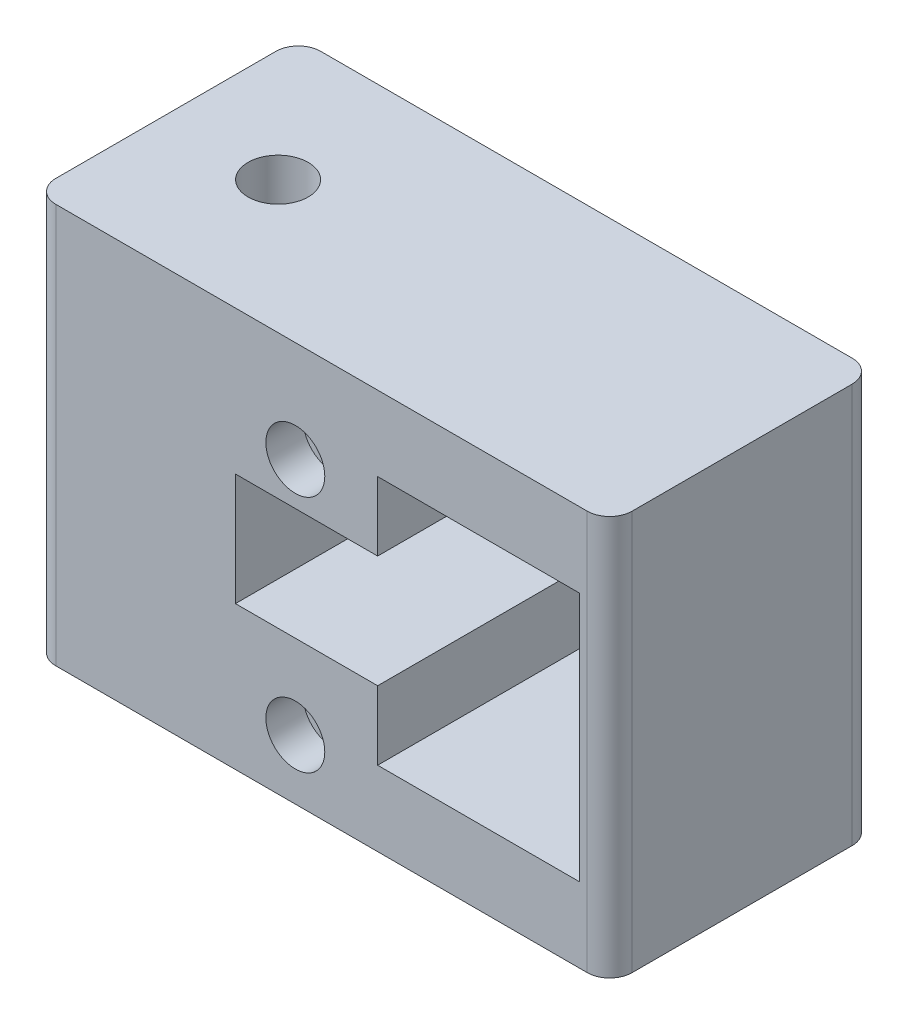
ISO-10303-21;
HEADER;
FILE_DESCRIPTION(('STEP AP214'),'2;1');
FILE_NAME('part.step','',(''),(''),'','','');
FILE_SCHEMA(('AUTOMOTIVE_DESIGN { 1 0 10303 214 1 1 1 1 }'));
ENDSEC;
DATA;
#1=APPLICATION_CONTEXT('core data for automotive mechanical design processes');
#2=APPLICATION_PROTOCOL_DEFINITION('international standard','automotive_design',2000,#1);
#3=PRODUCT_CONTEXT('',#1,'mechanical');
#4=PRODUCT('Part','Part','',(#3));
#5=PRODUCT_RELATED_PRODUCT_CATEGORY('part','',(#4));
#6=PRODUCT_DEFINITION_FORMATION('','',#4);
#7=PRODUCT_DEFINITION_CONTEXT('part definition',#1,'design');
#8=PRODUCT_DEFINITION('design','',#6,#7);
#9=PRODUCT_DEFINITION_SHAPE('','',#8);
#10=(LENGTH_UNIT() NAMED_UNIT(*) SI_UNIT(.MILLI.,.METRE.));
#11=(NAMED_UNIT(*) PLANE_ANGLE_UNIT() SI_UNIT($,.RADIAN.));
#12=(NAMED_UNIT(*) SI_UNIT($,.STERADIAN.) SOLID_ANGLE_UNIT());
#13=UNCERTAINTY_MEASURE_WITH_UNIT(LENGTH_MEASURE(1.E-05),#10,'distance_accuracy_value','');
#14=(GEOMETRIC_REPRESENTATION_CONTEXT(3) GLOBAL_UNCERTAINTY_ASSIGNED_CONTEXT((#13)) GLOBAL_UNIT_ASSIGNED_CONTEXT((#10,
#11,#12)) REPRESENTATION_CONTEXT('',''));
#15=CARTESIAN_POINT('',(0.,0.,0.));
#16=DIRECTION('',(0.,0.,1.));
#17=DIRECTION('',(1.,0.,0.));
#18=AXIS2_PLACEMENT_3D('',#15,#16,#17);
#19=CARTESIAN_POINT('',(-31.75,55.118,19.939));
#20=DIRECTION('',(0.,-1.,0.));
#21=DIRECTION('',(0.,0.,-1.));
#22=AXIS2_PLACEMENT_3D('',#19,#20,#21);
#23=CYLINDRICAL_SURFACE('',#22,4.064);
#24=CARTESIAN_POINT('',(-31.75,-12.7,19.939));
#25=DIRECTION('',(0.,-1.,0.));
#26=DIRECTION('',(0.,0.,-1.));
#27=AXIS2_PLACEMENT_3D('',#24,#25,#26);
#28=CIRCLE('',#27,4.064);
#29=CARTESIAN_POINT('',(-31.75,-12.7,15.875));
#30=VERTEX_POINT('',#29);
#31=EDGE_CURVE('E280',#30,#30,#28,.T.);
#32=ORIENTED_EDGE('',*,*,#31,.T.);
#33=EDGE_LOOP('',(#32));
#34=FACE_BOUND('',#33,.T.);
#35=CARTESIAN_POINT('',(-31.75,39.878,19.939));
#36=DIRECTION('',(0.,1.,0.));
#37=DIRECTION('',(0.,0.,1.));
#38=AXIS2_PLACEMENT_3D('',#35,#36,#37);
#39=CIRCLE('',#38,4.064);
#40=CARTESIAN_POINT('',(-31.75,39.878,24.003));
#41=VERTEX_POINT('',#40);
#42=EDGE_CURVE('E215',#41,#41,#39,.F.);
#43=ORIENTED_EDGE('',*,*,#42,.F.);
#44=EDGE_LOOP('',(#43));
#45=FACE_BOUND('',#44,.T.);
#46=ADVANCED_FACE('F35',(#34,#45),#23,.F.);
#47=CARTESIAN_POINT('',(0.,0.,42.418));
#48=DIRECTION('',(0.,0.,1.));
#49=DIRECTION('',(1.,0.,0.));
#50=AXIS2_PLACEMENT_3D('',#47,#48,#49);
#51=PLANE('',#50);
#52=CARTESIAN_POINT('',(-6.34999999999998,37.96,42.418));
#53=DIRECTION('',(0.,0.,1.));
#54=DIRECTION('',(1.,0.,0.));
#55=AXIS2_PLACEMENT_3D('',#52,#53,#54);
#56=CIRCLE('',#55,5.);
#57=CARTESIAN_POINT('',(-1.34999999999998,37.96,42.418));
#58=VERTEX_POINT('',#57);
#59=EDGE_CURVE('E585',#58,#58,#56,.T.);
#60=ORIENTED_EDGE('',*,*,#59,.F.);
#61=EDGE_LOOP('',(#60));
#62=FACE_BOUND('',#61,.T.);
#63=CARTESIAN_POINT('',(-6.34999999999998,-2.54,42.418));
#64=DIRECTION('',(0.,0.,1.));
#65=DIRECTION('',(1.,0.,0.));
#66=AXIS2_PLACEMENT_3D('',#63,#64,#65);
#67=CIRCLE('',#66,5.);
#68=CARTESIAN_POINT('',(-1.34999999999998,-2.54,42.418));
#69=VERTEX_POINT('',#68);
#70=EDGE_CURVE('E218',#69,#69,#67,.T.);
#71=ORIENTED_EDGE('',*,*,#70,.F.);
#72=EDGE_LOOP('',(#71));
#73=FACE_BOUND('',#72,.T.);
#74=DIRECTION('',(-1.,0.,0.));
#75=VECTOR('',#74,1.);
#76=CARTESIAN_POINT('',(-50.8,55.118,42.418));
#77=LINE('',#76,#75);
#78=CARTESIAN_POINT('',(43.18,55.118,42.418));
#79=VERTEX_POINT('',#78);
#80=CARTESIAN_POINT('',(-46.99,55.118,42.418));
#81=VERTEX_POINT('',#80);
#82=EDGE_CURVE('E199',#79,#81,#77,.T.);
#83=ORIENTED_EDGE('',*,*,#82,.T.);
#84=DIRECTION('',(0.,-1.,0.));
#85=VECTOR('',#84,1.);
#86=CARTESIAN_POINT('',(-46.99,-12.7,42.418));
#87=LINE('',#86,#85);
#88=CARTESIAN_POINT('',(-46.99,-12.7,42.418));
#89=VERTEX_POINT('',#88);
#90=EDGE_CURVE('E246',#81,#89,#87,.T.);
#91=ORIENTED_EDGE('',*,*,#90,.T.);
#92=DIRECTION('',(1.,0.,0.));
#93=VECTOR('',#92,1.);
#94=CARTESIAN_POINT('',(-50.8,-12.7,42.418));
#95=LINE('',#94,#93);
#96=CARTESIAN_POINT('',(43.18,-12.7,42.418));
#97=VERTEX_POINT('',#96);
#98=EDGE_CURVE('E197',#89,#97,#95,.T.);
#99=ORIENTED_EDGE('',*,*,#98,.T.);
#100=DIRECTION('',(0.,1.,0.));
#101=VECTOR('',#100,1.);
#102=CARTESIAN_POINT('',(43.18,55.118,42.418));
#103=LINE('',#102,#101);
#104=EDGE_CURVE('E243',#97,#79,#103,.T.);
#105=ORIENTED_EDGE('',*,*,#104,.T.);
#106=EDGE_LOOP('',(#83,#91,#99,#105));
#107=FACE_BOUND('',#106,.T.);
#108=DIRECTION('',(1.,0.,0.));
#109=VECTOR('',#108,1.);
#110=CARTESIAN_POINT('',(7.62,0.,42.418));
#111=LINE('',#110,#109);
#112=CARTESIAN_POINT('',(7.62,0.,42.418));
#113=VERTEX_POINT('',#112);
#114=CARTESIAN_POINT('',(41.91,0.,42.418));
#115=VERTEX_POINT('',#114);
#116=EDGE_CURVE('E179',#113,#115,#111,.T.);
#117=ORIENTED_EDGE('',*,*,#116,.F.);
#118=DIRECTION('',(0.,-1.,0.));
#119=VECTOR('',#118,1.);
#120=CARTESIAN_POINT('',(7.62,0.,42.418));
#121=LINE('',#120,#119);
#122=CARTESIAN_POINT('',(7.62,11.684,42.418));
#123=VERTEX_POINT('',#122);
#124=EDGE_CURVE('E177',#123,#113,#121,.T.);
#125=ORIENTED_EDGE('',*,*,#124,.F.);
#126=DIRECTION('',(1.,0.,0.));
#127=VECTOR('',#126,1.);
#128=CARTESIAN_POINT('',(7.62,11.684,42.418));
#129=LINE('',#128,#127);
#130=CARTESIAN_POINT('',(-16.51,11.684,42.418));
#131=VERTEX_POINT('',#130);
#132=EDGE_CURVE('E157',#131,#123,#129,.T.);
#133=ORIENTED_EDGE('',*,*,#132,.F.);
#134=DIRECTION('',(0.,-1.,0.));
#135=VECTOR('',#134,1.);
#136=CARTESIAN_POINT('',(-16.51,30.734,42.418));
#137=LINE('',#136,#135);
#138=CARTESIAN_POINT('',(-16.51,30.734,42.418));
#139=VERTEX_POINT('',#138);
#140=EDGE_CURVE('E297',#139,#131,#137,.T.);
#141=ORIENTED_EDGE('',*,*,#140,.F.);
#142=DIRECTION('',(-1.,0.,0.));
#143=VECTOR('',#142,1.);
#144=CARTESIAN_POINT('',(7.62,30.734,42.418));
#145=LINE('',#144,#143);
#146=CARTESIAN_POINT('',(7.62,30.734,42.418));
#147=VERTEX_POINT('',#146);
#148=EDGE_CURVE('E295',#147,#139,#145,.T.);
#149=ORIENTED_EDGE('',*,*,#148,.F.);
#150=DIRECTION('',(0.,-1.,0.));
#151=VECTOR('',#150,1.);
#152=CARTESIAN_POINT('',(7.62,30.734,42.418));
#153=LINE('',#152,#151);
#154=CARTESIAN_POINT('',(7.62,42.418,42.418));
#155=VERTEX_POINT('',#154);
#156=EDGE_CURVE('E293',#155,#147,#153,.T.);
#157=ORIENTED_EDGE('',*,*,#156,.F.);
#158=DIRECTION('',(-1.,0.,0.));
#159=VECTOR('',#158,1.);
#160=CARTESIAN_POINT('',(7.62,42.418,42.418));
#161=LINE('',#160,#159);
#162=CARTESIAN_POINT('',(41.91,42.418,42.418));
#163=VERTEX_POINT('',#162);
#164=EDGE_CURVE('E291',#163,#155,#161,.T.);
#165=ORIENTED_EDGE('',*,*,#164,.F.);
#166=DIRECTION('',(0.,1.,0.));
#167=VECTOR('',#166,1.);
#168=CARTESIAN_POINT('',(41.91,0.,42.418));
#169=LINE('',#168,#167);
#170=EDGE_CURVE('E289',#115,#163,#169,.T.);
#171=ORIENTED_EDGE('',*,*,#170,.F.);
#172=EDGE_LOOP('',(#117,#125,#133,#141,#149,#157,#165,#171));
#173=FACE_BOUND('',#172,.T.);
#174=ADVANCED_FACE('F258',(#62,#73,#107,#173),#51,.T.);
#175=CARTESIAN_POINT('',(-50.8,55.118,42.418));
#176=DIRECTION('',(1.,0.,0.));
#177=DIRECTION('',(0.,1.,0.));
#178=AXIS2_PLACEMENT_3D('',#175,#176,#177);
#179=PLANE('',#178);
#180=DIRECTION('',(0.,0.,-1.));
#181=VECTOR('',#180,1.);
#182=CARTESIAN_POINT('',(-50.8,55.118,42.418));
#183=LINE('',#182,#181);
#184=CARTESIAN_POINT('',(-50.8,55.118,38.608));
#185=VERTEX_POINT('',#184);
#186=CARTESIAN_POINT('',(-50.8,55.118,1.27));
#187=VERTEX_POINT('',#186);
#188=EDGE_CURVE('E202',#185,#187,#183,.T.);
#189=ORIENTED_EDGE('',*,*,#188,.T.);
#190=DIRECTION('',(0.,1.,0.));
#191=VECTOR('',#190,1.);
#192=CARTESIAN_POINT('',(-50.8,-12.7,1.27));
#193=LINE('',#192,#191);
#194=CARTESIAN_POINT('',(-50.8,-12.7,1.27));
#195=VERTEX_POINT('',#194);
#196=EDGE_CURVE('E235',#187,#195,#193,.F.);
#197=ORIENTED_EDGE('',*,*,#196,.T.);
#198=DIRECTION('',(0.,0.,-1.));
#199=VECTOR('',#198,1.);
#200=CARTESIAN_POINT('',(-50.8,-12.7,42.418));
#201=LINE('',#200,#199);
#202=CARTESIAN_POINT('',(-50.8,-12.7,38.608));
#203=VERTEX_POINT('',#202);
#204=EDGE_CURVE('E211',#203,#195,#201,.T.);
#205=ORIENTED_EDGE('',*,*,#204,.F.);
#206=DIRECTION('',(0.,-1.,0.));
#207=VECTOR('',#206,1.);
#208=CARTESIAN_POINT('',(-50.8,55.118,38.608));
#209=LINE('',#208,#207);
#210=EDGE_CURVE('E233',#203,#185,#209,.F.);
#211=ORIENTED_EDGE('',*,*,#210,.T.);
#212=EDGE_LOOP('',(#189,#197,#205,#211));
#213=FACE_BOUND('',#212,.T.);
#214=ADVANCED_FACE('F269',(#213),#179,.F.);
#215=CARTESIAN_POINT('',(-50.8,-12.7,42.418));
#216=DIRECTION('',(0.,1.,0.));
#217=DIRECTION('',(0.,0.,1.));
#218=AXIS2_PLACEMENT_3D('',#215,#216,#217);
#219=PLANE('',#218);
#220=ORIENTED_EDGE('',*,*,#31,.F.);
#221=EDGE_LOOP('',(#220));
#222=FACE_BOUND('',#221,.T.);
#223=ORIENTED_EDGE('',*,*,#204,.T.);
#224=CARTESIAN_POINT('',(-46.99,-12.7,1.27));
#225=DIRECTION('',(0.,1.,0.));
#226=DIRECTION('',(0.,0.,1.));
#227=AXIS2_PLACEMENT_3D('',#224,#225,#226);
#228=CIRCLE('',#227,3.81);
#229=CARTESIAN_POINT('',(-46.99,-12.7,-2.54));
#230=VERTEX_POINT('',#229);
#231=EDGE_CURVE('E241',#195,#230,#228,.F.);
#232=ORIENTED_EDGE('',*,*,#231,.T.);
#233=DIRECTION('',(-1.,0.,0.));
#234=VECTOR('',#233,1.);
#235=CARTESIAN_POINT('',(46.99,-12.7,-2.54));
#236=LINE('',#235,#234);
#237=CARTESIAN_POINT('',(43.18,-12.7,-2.54));
#238=VERTEX_POINT('',#237);
#239=EDGE_CURVE('E275',#238,#230,#236,.T.);
#240=ORIENTED_EDGE('',*,*,#239,.F.);
#241=CARTESIAN_POINT('',(43.18,-12.7,1.27));
#242=DIRECTION('',(0.,1.,0.));
#243=DIRECTION('',(0.,0.,1.));
#244=AXIS2_PLACEMENT_3D('',#241,#242,#243);
#245=CIRCLE('',#244,3.81);
#246=CARTESIAN_POINT('',(46.99,-12.7,1.27));
#247=VERTEX_POINT('',#246);
#248=EDGE_CURVE('E238',#238,#247,#245,.F.);
#249=ORIENTED_EDGE('',*,*,#248,.T.);
#250=DIRECTION('',(0.,0.,-1.));
#251=VECTOR('',#250,1.);
#252=CARTESIAN_POINT('',(46.99,-12.7,42.418));
#253=LINE('',#252,#251);
#254=CARTESIAN_POINT('',(46.99,-12.7,38.608));
#255=VERTEX_POINT('',#254);
#256=EDGE_CURVE('E208',#255,#247,#253,.T.);
#257=ORIENTED_EDGE('',*,*,#256,.F.);
#258=CARTESIAN_POINT('',(43.18,-12.7,38.608));
#259=DIRECTION('',(0.,1.,0.));
#260=DIRECTION('',(0.,0.,1.));
#261=AXIS2_PLACEMENT_3D('',#258,#259,#260);
#262=CIRCLE('',#261,3.81);
#263=EDGE_CURVE('E50',#255,#97,#262,.F.);
#264=ORIENTED_EDGE('',*,*,#263,.T.);
#265=ORIENTED_EDGE('',*,*,#98,.F.);
#266=CARTESIAN_POINT('',(-46.99,-12.7,38.608));
#267=DIRECTION('',(0.,1.,0.));
#268=DIRECTION('',(0.,0.,1.));
#269=AXIS2_PLACEMENT_3D('',#266,#267,#268);
#270=CIRCLE('',#269,3.81);
#271=EDGE_CURVE('E58',#89,#203,#270,.F.);
#272=ORIENTED_EDGE('',*,*,#271,.T.);
#273=EDGE_LOOP('',(#223,#232,#240,#249,#257,#264,#265,#272));
#274=FACE_BOUND('',#273,.T.);
#275=ADVANCED_FACE('F253',(#222,#274),#219,.F.);
#276=CARTESIAN_POINT('',(46.99,55.118,42.418));
#277=DIRECTION('',(-1.,0.,0.));
#278=DIRECTION('',(0.,-1.,0.));
#279=AXIS2_PLACEMENT_3D('',#276,#277,#278);
#280=PLANE('',#279);
#281=ORIENTED_EDGE('',*,*,#256,.T.);
#282=DIRECTION('',(0.,-1.,0.));
#283=VECTOR('',#282,1.);
#284=CARTESIAN_POINT('',(46.99,55.118,1.27));
#285=LINE('',#284,#283);
#286=CARTESIAN_POINT('',(46.99,55.118,1.27));
#287=VERTEX_POINT('',#286);
#288=EDGE_CURVE('E11',#247,#287,#285,.F.);
#289=ORIENTED_EDGE('',*,*,#288,.T.);
#290=DIRECTION('',(0.,0.,-1.));
#291=VECTOR('',#290,1.);
#292=CARTESIAN_POINT('',(46.99,55.118,42.418));
#293=LINE('',#292,#291);
#294=CARTESIAN_POINT('',(46.99,55.118,38.608));
#295=VERTEX_POINT('',#294);
#296=EDGE_CURVE('E205',#295,#287,#293,.T.);
#297=ORIENTED_EDGE('',*,*,#296,.F.);
#298=DIRECTION('',(0.,1.,0.));
#299=VECTOR('',#298,1.);
#300=CARTESIAN_POINT('',(46.99,-12.7,38.608));
#301=LINE('',#300,#299);
#302=EDGE_CURVE('E43',#295,#255,#301,.F.);
#303=ORIENTED_EDGE('',*,*,#302,.T.);
#304=EDGE_LOOP('',(#281,#289,#297,#303));
#305=FACE_BOUND('',#304,.T.);
#306=ADVANCED_FACE('F250',(#305),#280,.F.);
#307=CARTESIAN_POINT('',(-50.8,55.118,42.418));
#308=DIRECTION('',(0.,-1.,0.));
#309=DIRECTION('',(0.,0.,-1.));
#310=AXIS2_PLACEMENT_3D('',#307,#308,#309);
#311=PLANE('',#310);
#312=CARTESIAN_POINT('',(-31.75,55.118,19.939));
#313=DIRECTION('',(0.,1.,0.));
#314=DIRECTION('',(0.,0.,1.));
#315=AXIS2_PLACEMENT_3D('',#312,#313,#314);
#316=CIRCLE('',#315,5.1);
#317=CARTESIAN_POINT('',(-31.75,55.118,25.039));
#318=VERTEX_POINT('',#317);
#319=EDGE_CURVE('E577',#318,#318,#316,.T.);
#320=ORIENTED_EDGE('',*,*,#319,.F.);
#321=EDGE_LOOP('',(#320));
#322=FACE_BOUND('',#321,.T.);
#323=DIRECTION('',(1.,0.,0.));
#324=VECTOR('',#323,1.);
#325=CARTESIAN_POINT('',(46.99,55.118,-2.54));
#326=LINE('',#325,#324);
#327=CARTESIAN_POINT('',(-46.99,55.118,-2.54));
#328=VERTEX_POINT('',#327);
#329=CARTESIAN_POINT('',(43.18,55.118,-2.54));
#330=VERTEX_POINT('',#329);
#331=EDGE_CURVE('E171',#328,#330,#326,.T.);
#332=ORIENTED_EDGE('',*,*,#331,.F.);
#333=CARTESIAN_POINT('',(-46.99,55.118,1.27));
#334=DIRECTION('',(0.,-1.,0.));
#335=DIRECTION('',(0.,0.,-1.));
#336=AXIS2_PLACEMENT_3D('',#333,#334,#335);
#337=CIRCLE('',#336,3.81);
#338=EDGE_CURVE('E231',#328,#187,#337,.F.);
#339=ORIENTED_EDGE('',*,*,#338,.T.);
#340=ORIENTED_EDGE('',*,*,#188,.F.);
#341=CARTESIAN_POINT('',(-46.99,55.118,38.608));
#342=DIRECTION('',(0.,-1.,0.));
#343=DIRECTION('',(0.,0.,-1.));
#344=AXIS2_PLACEMENT_3D('',#341,#342,#343);
#345=CIRCLE('',#344,3.81);
#346=EDGE_CURVE('E229',#185,#81,#345,.F.);
#347=ORIENTED_EDGE('',*,*,#346,.T.);
#348=ORIENTED_EDGE('',*,*,#82,.F.);
#349=CARTESIAN_POINT('',(43.18,55.118,38.608));
#350=DIRECTION('',(0.,-1.,0.));
#351=DIRECTION('',(0.,0.,-1.));
#352=AXIS2_PLACEMENT_3D('',#349,#350,#351);
#353=CIRCLE('',#352,3.81);
#354=EDGE_CURVE('E225',#79,#295,#353,.F.);
#355=ORIENTED_EDGE('',*,*,#354,.T.);
#356=ORIENTED_EDGE('',*,*,#296,.T.);
#357=CARTESIAN_POINT('',(43.18,55.118,1.27));
#358=DIRECTION('',(0.,-1.,0.));
#359=DIRECTION('',(0.,0.,-1.));
#360=AXIS2_PLACEMENT_3D('',#357,#358,#359);
#361=CIRCLE('',#360,3.81);
#362=EDGE_CURVE('E227',#287,#330,#361,.F.);
#363=ORIENTED_EDGE('',*,*,#362,.T.);
#364=EDGE_LOOP('',(#332,#339,#340,#347,#348,#355,#356,#363));
#365=FACE_BOUND('',#364,.T.);
#366=ADVANCED_FACE('F262',(#322,#365),#311,.F.);
#367=CARTESIAN_POINT('',(7.62,0.,42.418));
#368=DIRECTION('',(1.,0.,0.));
#369=DIRECTION('',(0.,1.,0.));
#370=AXIS2_PLACEMENT_3D('',#367,#368,#369);
#371=PLANE('',#370);
#372=DIRECTION('',(0.,-1.,0.));
#373=VECTOR('',#372,1.);
#374=CARTESIAN_POINT('',(7.62,0.,0.));
#375=LINE('',#374,#373);
#376=CARTESIAN_POINT('',(7.62,11.684,0.));
#377=VERTEX_POINT('',#376);
#378=CARTESIAN_POINT('',(7.62,0.,0.));
#379=VERTEX_POINT('',#378);
#380=EDGE_CURVE('E164',#377,#379,#375,.T.);
#381=ORIENTED_EDGE('',*,*,#380,.F.);
#382=DIRECTION('',(0.,0.,-1.));
#383=VECTOR('',#382,1.);
#384=CARTESIAN_POINT('',(7.62,11.684,42.418));
#385=LINE('',#384,#383);
#386=EDGE_CURVE('E150',#123,#377,#385,.T.);
#387=ORIENTED_EDGE('',*,*,#386,.F.);
#388=ORIENTED_EDGE('',*,*,#124,.T.);
#389=DIRECTION('',(0.,0.,-1.));
#390=VECTOR('',#389,1.);
#391=CARTESIAN_POINT('',(7.62,0.,42.418));
#392=LINE('',#391,#390);
#393=EDGE_CURVE('E167',#113,#379,#392,.T.);
#394=ORIENTED_EDGE('',*,*,#393,.T.);
#395=EDGE_LOOP('',(#381,#387,#388,#394));
#396=FACE_BOUND('',#395,.T.);
#397=ADVANCED_FACE('F165',(#396),#371,.T.);
#398=CARTESIAN_POINT('',(7.62,0.,42.418));
#399=DIRECTION('',(0.,1.,0.));
#400=DIRECTION('',(0.,0.,1.));
#401=AXIS2_PLACEMENT_3D('',#398,#399,#400);
#402=PLANE('',#401);
#403=DIRECTION('',(1.,0.,0.));
#404=VECTOR('',#403,1.);
#405=CARTESIAN_POINT('',(7.62,0.,0.));
#406=LINE('',#405,#404);
#407=CARTESIAN_POINT('',(41.91,0.,0.));
#408=VERTEX_POINT('',#407);
#409=EDGE_CURVE('E170',#379,#408,#406,.T.);
#410=ORIENTED_EDGE('',*,*,#409,.F.);
#411=ORIENTED_EDGE('',*,*,#393,.F.);
#412=ORIENTED_EDGE('',*,*,#116,.T.);
#413=DIRECTION('',(0.,0.,-1.));
#414=VECTOR('',#413,1.);
#415=CARTESIAN_POINT('',(41.91,0.,42.418));
#416=LINE('',#415,#414);
#417=EDGE_CURVE('E194',#115,#408,#416,.T.);
#418=ORIENTED_EDGE('',*,*,#417,.T.);
#419=EDGE_LOOP('',(#410,#411,#412,#418));
#420=FACE_BOUND('',#419,.T.);
#421=ADVANCED_FACE('F323',(#420),#402,.T.);
#422=CARTESIAN_POINT('',(41.91,0.,42.418));
#423=DIRECTION('',(-1.,0.,0.));
#424=DIRECTION('',(0.,-1.,0.));
#425=AXIS2_PLACEMENT_3D('',#422,#423,#424);
#426=PLANE('',#425);
#427=DIRECTION('',(0.,1.,0.));
#428=VECTOR('',#427,1.);
#429=CARTESIAN_POINT('',(41.91,0.,0.));
#430=LINE('',#429,#428);
#431=CARTESIAN_POINT('',(41.91,42.418,0.));
#432=VERTEX_POINT('',#431);
#433=EDGE_CURVE('E302',#408,#432,#430,.T.);
#434=ORIENTED_EDGE('',*,*,#433,.F.);
#435=ORIENTED_EDGE('',*,*,#417,.F.);
#436=ORIENTED_EDGE('',*,*,#170,.T.);
#437=DIRECTION('',(0.,0.,-1.));
#438=VECTOR('',#437,1.);
#439=CARTESIAN_POINT('',(41.91,42.418,42.418));
#440=LINE('',#439,#438);
#441=EDGE_CURVE('E192',#163,#432,#440,.T.);
#442=ORIENTED_EDGE('',*,*,#441,.T.);
#443=EDGE_LOOP('',(#434,#435,#436,#442));
#444=FACE_BOUND('',#443,.T.);
#445=ADVANCED_FACE('F328',(#444),#426,.T.);
#446=CARTESIAN_POINT('',(7.62,42.418,42.418));
#447=DIRECTION('',(0.,-1.,0.));
#448=DIRECTION('',(0.,0.,-1.));
#449=AXIS2_PLACEMENT_3D('',#446,#447,#448);
#450=PLANE('',#449);
#451=DIRECTION('',(-1.,0.,0.));
#452=VECTOR('',#451,1.);
#453=CARTESIAN_POINT('',(7.62,42.418,0.));
#454=LINE('',#453,#452);
#455=CARTESIAN_POINT('',(7.62,42.418,0.));
#456=VERTEX_POINT('',#455);
#457=EDGE_CURVE('E305',#432,#456,#454,.T.);
#458=ORIENTED_EDGE('',*,*,#457,.F.);
#459=ORIENTED_EDGE('',*,*,#441,.F.);
#460=ORIENTED_EDGE('',*,*,#164,.T.);
#461=DIRECTION('',(0.,0.,-1.));
#462=VECTOR('',#461,1.);
#463=CARTESIAN_POINT('',(7.62,42.418,42.418));
#464=LINE('',#463,#462);
#465=EDGE_CURVE('E190',#155,#456,#464,.T.);
#466=ORIENTED_EDGE('',*,*,#465,.T.);
#467=EDGE_LOOP('',(#458,#459,#460,#466));
#468=FACE_BOUND('',#467,.T.);
#469=ADVANCED_FACE('F332',(#468),#450,.T.);
#470=CARTESIAN_POINT('',(7.62,30.734,42.418));
#471=DIRECTION('',(1.,0.,0.));
#472=DIRECTION('',(0.,1.,0.));
#473=AXIS2_PLACEMENT_3D('',#470,#471,#472);
#474=PLANE('',#473);
#475=DIRECTION('',(0.,-1.,0.));
#476=VECTOR('',#475,1.);
#477=CARTESIAN_POINT('',(7.62,30.734,0.));
#478=LINE('',#477,#476);
#479=CARTESIAN_POINT('',(7.62,30.734,0.));
#480=VERTEX_POINT('',#479);
#481=EDGE_CURVE('E308',#456,#480,#478,.T.);
#482=ORIENTED_EDGE('',*,*,#481,.F.);
#483=ORIENTED_EDGE('',*,*,#465,.F.);
#484=ORIENTED_EDGE('',*,*,#156,.T.);
#485=DIRECTION('',(0.,0.,-1.));
#486=VECTOR('',#485,1.);
#487=CARTESIAN_POINT('',(7.62,30.734,42.418));
#488=LINE('',#487,#486);
#489=EDGE_CURVE('E188',#147,#480,#488,.T.);
#490=ORIENTED_EDGE('',*,*,#489,.T.);
#491=EDGE_LOOP('',(#482,#483,#484,#490));
#492=FACE_BOUND('',#491,.T.);
#493=ADVANCED_FACE('F336',(#492),#474,.T.);
#494=CARTESIAN_POINT('',(7.62,30.734,42.418));
#495=DIRECTION('',(0.,-1.,0.));
#496=DIRECTION('',(1.,0.,0.));
#497=AXIS2_PLACEMENT_3D('',#494,#495,#496);
#498=PLANE('',#497);
#499=DIRECTION('',(-1.,0.,0.));
#500=VECTOR('',#499,1.);
#501=CARTESIAN_POINT('',(7.62,30.734,0.));
#502=LINE('',#501,#500);
#503=CARTESIAN_POINT('',(-16.51,30.734,0.));
#504=VERTEX_POINT('',#503);
#505=EDGE_CURVE('E181',#480,#504,#502,.T.);
#506=ORIENTED_EDGE('',*,*,#505,.F.);
#507=ORIENTED_EDGE('',*,*,#489,.F.);
#508=ORIENTED_EDGE('',*,*,#148,.T.);
#509=DIRECTION('',(0.,0.,-1.));
#510=VECTOR('',#509,1.);
#511=CARTESIAN_POINT('',(-16.51,30.734,42.418));
#512=LINE('',#511,#510);
#513=EDGE_CURVE('E186',#139,#504,#512,.T.);
#514=ORIENTED_EDGE('',*,*,#513,.T.);
#515=EDGE_LOOP('',(#506,#507,#508,#514));
#516=FACE_BOUND('',#515,.T.);
#517=ADVANCED_FACE('F314',(#516),#498,.T.);
#518=CARTESIAN_POINT('',(-16.51,30.734,42.418));
#519=DIRECTION('',(1.,0.,0.));
#520=DIRECTION('',(0.,0.,-1.));
#521=AXIS2_PLACEMENT_3D('',#518,#519,#520);
#522=PLANE('',#521);
#523=DIRECTION('',(0.,-1.,0.));
#524=VECTOR('',#523,1.);
#525=CARTESIAN_POINT('',(-16.51,30.734,0.));
#526=LINE('',#525,#524);
#527=CARTESIAN_POINT('',(-16.51,11.684,0.));
#528=VERTEX_POINT('',#527);
#529=EDGE_CURVE('E176',#504,#528,#526,.T.);
#530=ORIENTED_EDGE('',*,*,#529,.F.);
#531=ORIENTED_EDGE('',*,*,#513,.F.);
#532=ORIENTED_EDGE('',*,*,#140,.T.);
#533=DIRECTION('',(0.,0.,-1.));
#534=VECTOR('',#533,1.);
#535=CARTESIAN_POINT('',(-16.51,11.684,42.418));
#536=LINE('',#535,#534);
#537=EDGE_CURVE('E160',#131,#528,#536,.T.);
#538=ORIENTED_EDGE('',*,*,#537,.T.);
#539=EDGE_LOOP('',(#530,#531,#532,#538));
#540=FACE_BOUND('',#539,.T.);
#541=ADVANCED_FACE('F319',(#540),#522,.T.);
#542=CARTESIAN_POINT('',(7.62,11.684,42.418));
#543=DIRECTION('',(0.,1.,0.));
#544=DIRECTION('',(-1.,0.,0.));
#545=AXIS2_PLACEMENT_3D('',#542,#543,#544);
#546=PLANE('',#545);
#547=DIRECTION('',(1.,0.,0.));
#548=VECTOR('',#547,1.);
#549=CARTESIAN_POINT('',(7.62,11.684,0.));
#550=LINE('',#549,#548);
#551=EDGE_CURVE('E154',#528,#377,#550,.T.);
#552=ORIENTED_EDGE('',*,*,#551,.F.);
#553=ORIENTED_EDGE('',*,*,#537,.F.);
#554=ORIENTED_EDGE('',*,*,#132,.T.);
#555=ORIENTED_EDGE('',*,*,#386,.T.);
#556=EDGE_LOOP('',(#552,#553,#554,#555));
#557=FACE_BOUND('',#556,.T.);
#558=ADVANCED_FACE('F152',(#557),#546,.T.);
#559=CARTESIAN_POINT('',(0.,0.,0.));
#560=DIRECTION('',(0.,0.,-1.));
#561=DIRECTION('',(-1.,0.,0.));
#562=AXIS2_PLACEMENT_3D('',#559,#560,#561);
#563=PLANE('',#562);
#564=ORIENTED_EDGE('',*,*,#551,.T.);
#565=ORIENTED_EDGE('',*,*,#380,.T.);
#566=ORIENTED_EDGE('',*,*,#409,.T.);
#567=ORIENTED_EDGE('',*,*,#433,.T.);
#568=ORIENTED_EDGE('',*,*,#457,.T.);
#569=ORIENTED_EDGE('',*,*,#481,.T.);
#570=ORIENTED_EDGE('',*,*,#505,.T.);
#571=ORIENTED_EDGE('',*,*,#529,.T.);
#572=EDGE_LOOP('',(#564,#565,#566,#567,#568,#569,#570,#571));
#573=FACE_BOUND('',#572,.T.);
#574=ADVANCED_FACE('F173',(#573),#563,.F.);
#575=CARTESIAN_POINT('',(0.,0.,-2.54));
#576=DIRECTION('',(0.,0.,-1.));
#577=DIRECTION('',(-1.,0.,0.));
#578=AXIS2_PLACEMENT_3D('',#575,#576,#577);
#579=PLANE('',#578);
#580=ORIENTED_EDGE('',*,*,#239,.T.);
#581=DIRECTION('',(0.,1.,0.));
#582=VECTOR('',#581,1.);
#583=CARTESIAN_POINT('',(-46.99,55.118,-2.54));
#584=LINE('',#583,#582);
#585=EDGE_CURVE('E222',#230,#328,#584,.T.);
#586=ORIENTED_EDGE('',*,*,#585,.T.);
#587=ORIENTED_EDGE('',*,*,#331,.T.);
#588=DIRECTION('',(0.,-1.,0.));
#589=VECTOR('',#588,1.);
#590=CARTESIAN_POINT('',(43.18,-12.7,-2.54));
#591=LINE('',#590,#589);
#592=EDGE_CURVE('E214',#330,#238,#591,.T.);
#593=ORIENTED_EDGE('',*,*,#592,.T.);
#594=EDGE_LOOP('',(#580,#586,#587,#593));
#595=FACE_BOUND('',#594,.T.);
#596=ADVANCED_FACE('F277',(#595),#579,.T.);
#597=CARTESIAN_POINT('',(-6.34999999999998,-2.54,36.068));
#598=DIRECTION('',(0.,0.,1.));
#599=DIRECTION('',(1.,0.,0.));
#600=AXIS2_PLACEMENT_3D('',#597,#598,#599);
#601=CYLINDRICAL_SURFACE('',#600,5.);
#602=CARTESIAN_POINT('',(-6.34999999999998,-2.54,36.068));
#603=DIRECTION('',(0.,0.,1.));
#604=DIRECTION('',(1.,0.,0.));
#605=AXIS2_PLACEMENT_3D('',#602,#603,#604);
#606=CIRCLE('',#605,5.);
#607=CARTESIAN_POINT('',(-1.34999999999998,-2.54,36.068));
#608=VERTEX_POINT('',#607);
#609=EDGE_CURVE('E588',#608,#608,#606,.T.);
#610=ORIENTED_EDGE('',*,*,#609,.F.);
#611=EDGE_LOOP('',(#610));
#612=FACE_BOUND('',#611,.T.);
#613=ORIENTED_EDGE('',*,*,#70,.T.);
#614=EDGE_LOOP('',(#613));
#615=FACE_BOUND('',#614,.T.);
#616=ADVANCED_FACE('F356',(#612,#615),#601,.F.);
#617=CARTESIAN_POINT('',(-6.34999999999998,-2.54,36.068));
#618=DIRECTION('',(0.,0.,1.));
#619=DIRECTION('',(1.,0.,0.));
#620=AXIS2_PLACEMENT_3D('',#617,#618,#619);
#621=PLANE('',#620);
#622=ORIENTED_EDGE('',*,*,#609,.T.);
#623=EDGE_LOOP('',(#622));
#624=FACE_BOUND('',#623,.T.);
#625=ADVANCED_FACE('F389',(#624),#621,.T.);
#626=CARTESIAN_POINT('',(-6.34999999999998,37.96,36.068));
#627=DIRECTION('',(0.,0.,1.));
#628=DIRECTION('',(1.,0.,0.));
#629=AXIS2_PLACEMENT_3D('',#626,#627,#628);
#630=CYLINDRICAL_SURFACE('',#629,5.);
#631=CARTESIAN_POINT('',(-6.34999999999998,37.96,36.068));
#632=DIRECTION('',(0.,0.,1.));
#633=DIRECTION('',(1.,0.,0.));
#634=AXIS2_PLACEMENT_3D('',#631,#632,#633);
#635=CIRCLE('',#634,5.);
#636=CARTESIAN_POINT('',(-1.34999999999998,37.96,36.068));
#637=VERTEX_POINT('',#636);
#638=EDGE_CURVE('E284',#637,#637,#635,.T.);
#639=ORIENTED_EDGE('',*,*,#638,.F.);
#640=EDGE_LOOP('',(#639));
#641=FACE_BOUND('',#640,.T.);
#642=ORIENTED_EDGE('',*,*,#59,.T.);
#643=EDGE_LOOP('',(#642));
#644=FACE_BOUND('',#643,.T.);
#645=ADVANCED_FACE('F396',(#641,#644),#630,.F.);
#646=CARTESIAN_POINT('',(-6.34999999999998,37.96,36.068));
#647=DIRECTION('',(0.,0.,1.));
#648=DIRECTION('',(1.,0.,0.));
#649=AXIS2_PLACEMENT_3D('',#646,#647,#648);
#650=PLANE('',#649);
#651=ORIENTED_EDGE('',*,*,#638,.T.);
#652=EDGE_LOOP('',(#651));
#653=FACE_BOUND('',#652,.T.);
#654=ADVANCED_FACE('F403',(#653),#650,.T.);
#655=CARTESIAN_POINT('',(-31.75,39.878,19.939));
#656=DIRECTION('',(0.,1.,0.));
#657=DIRECTION('',(0.,0.,1.));
#658=AXIS2_PLACEMENT_3D('',#655,#656,#657);
#659=PLANE('',#658);
#660=CARTESIAN_POINT('',(-31.75,39.878,19.939));
#661=DIRECTION('',(0.,1.,0.));
#662=DIRECTION('',(0.,0.,1.));
#663=AXIS2_PLACEMENT_3D('',#660,#661,#662);
#664=CIRCLE('',#663,5.1);
#665=CARTESIAN_POINT('',(-31.75,39.878,25.039));
#666=VERTEX_POINT('',#665);
#667=EDGE_CURVE('E219',#666,#666,#664,.T.);
#668=ORIENTED_EDGE('',*,*,#667,.T.);
#669=EDGE_LOOP('',(#668));
#670=FACE_BOUND('',#669,.T.);
#671=ORIENTED_EDGE('',*,*,#42,.T.);
#672=EDGE_LOOP('',(#671));
#673=FACE_BOUND('',#672,.T.);
#674=ADVANCED_FACE('F411',(#670,#673),#659,.T.);
#675=CARTESIAN_POINT('',(-31.75,39.878,19.939));
#676=DIRECTION('',(0.,1.,0.));
#677=DIRECTION('',(0.,0.,1.));
#678=AXIS2_PLACEMENT_3D('',#675,#676,#677);
#679=CYLINDRICAL_SURFACE('',#678,5.1);
#680=ORIENTED_EDGE('',*,*,#667,.F.);
#681=EDGE_LOOP('',(#680));
#682=FACE_BOUND('',#681,.T.);
#683=ORIENTED_EDGE('',*,*,#319,.T.);
#684=EDGE_LOOP('',(#683));
#685=FACE_BOUND('',#684,.T.);
#686=ADVANCED_FACE('F419',(#682,#685),#679,.F.);
#687=CARTESIAN_POINT('',(-46.99,0.,1.27));
#688=DIRECTION('',(0.,-1.,0.));
#689=DIRECTION('',(1.,0.,0.));
#690=AXIS2_PLACEMENT_3D('',#687,#688,#689);
#691=CYLINDRICAL_SURFACE('',#690,3.81);
#692=ORIENTED_EDGE('',*,*,#231,.F.);
#693=ORIENTED_EDGE('',*,*,#196,.F.);
#694=ORIENTED_EDGE('',*,*,#338,.F.);
#695=ORIENTED_EDGE('',*,*,#585,.F.);
#696=EDGE_LOOP('',(#692,#693,#694,#695));
#697=FACE_BOUND('',#696,.T.);
#698=ADVANCED_FACE('F272',(#697),#691,.T.);
#699=CARTESIAN_POINT('',(-46.99,0.,38.608));
#700=DIRECTION('',(0.,1.,0.));
#701=DIRECTION('',(-1.,0.,0.));
#702=AXIS2_PLACEMENT_3D('',#699,#700,#701);
#703=CYLINDRICAL_SURFACE('',#702,3.81);
#704=ORIENTED_EDGE('',*,*,#346,.F.);
#705=ORIENTED_EDGE('',*,*,#210,.F.);
#706=ORIENTED_EDGE('',*,*,#271,.F.);
#707=ORIENTED_EDGE('',*,*,#90,.F.);
#708=EDGE_LOOP('',(#704,#705,#706,#707));
#709=FACE_BOUND('',#708,.T.);
#710=ADVANCED_FACE('F265',(#709),#703,.T.);
#711=CARTESIAN_POINT('',(43.18,0.,1.27));
#712=DIRECTION('',(0.,1.,0.));
#713=DIRECTION('',(-1.,0.,0.));
#714=AXIS2_PLACEMENT_3D('',#711,#712,#713);
#715=CYLINDRICAL_SURFACE('',#714,3.81);
#716=ORIENTED_EDGE('',*,*,#362,.F.);
#717=ORIENTED_EDGE('',*,*,#288,.F.);
#718=ORIENTED_EDGE('',*,*,#248,.F.);
#719=ORIENTED_EDGE('',*,*,#592,.F.);
#720=EDGE_LOOP('',(#716,#717,#718,#719));
#721=FACE_BOUND('',#720,.T.);
#722=ADVANCED_FACE('F440',(#721),#715,.T.);
#723=CARTESIAN_POINT('',(43.18,0.,38.608));
#724=DIRECTION('',(0.,-1.,0.));
#725=DIRECTION('',(1.,0.,0.));
#726=AXIS2_PLACEMENT_3D('',#723,#724,#725);
#727=CYLINDRICAL_SURFACE('',#726,3.81);
#728=ORIENTED_EDGE('',*,*,#263,.F.);
#729=ORIENTED_EDGE('',*,*,#302,.F.);
#730=ORIENTED_EDGE('',*,*,#354,.F.);
#731=ORIENTED_EDGE('',*,*,#104,.F.);
#732=EDGE_LOOP('',(#728,#729,#730,#731));
#733=FACE_BOUND('',#732,.T.);
#734=ADVANCED_FACE('F37',(#733),#727,.T.);
#735=CLOSED_SHELL('',(#46,#174,#214,#275,#306,#366,#397,#421,#445,#469,#493,#517,#541,#558,#574,
#596,#616,#625,#645,#654,#674,#686,#698,#710,#722,#734));
#736=MANIFOLD_SOLID_BREP('B2',#735);
#737=ADVANCED_BREP_SHAPE_REPRESENTATION('',(#18,#736),#14);
#738=SHAPE_DEFINITION_REPRESENTATION(#9,#737);
ENDSEC;
END-ISO-10303-21;
